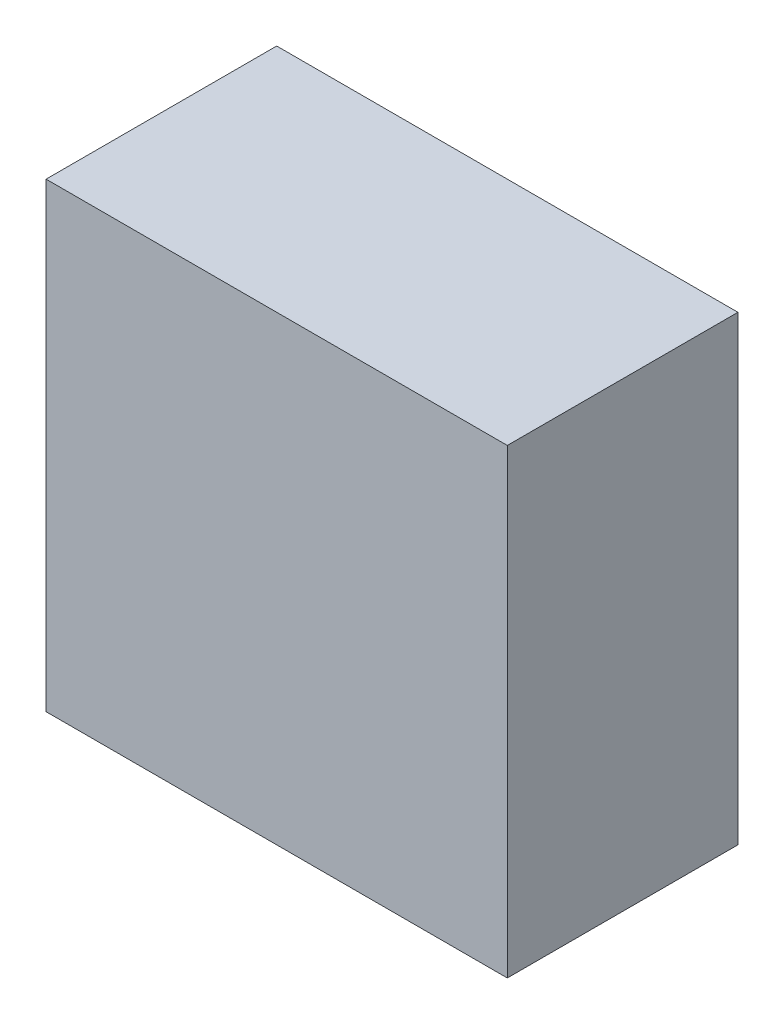
ISO-10303-21;
HEADER;
FILE_DESCRIPTION(('STEP AP214'),'2;1');
FILE_NAME('part.step','',(''),(''),'','','');
FILE_SCHEMA(('AUTOMOTIVE_DESIGN { 1 0 10303 214 1 1 1 1 }'));
ENDSEC;
DATA;
#1=APPLICATION_CONTEXT('core data for automotive mechanical design processes');
#2=APPLICATION_PROTOCOL_DEFINITION('international standard','automotive_design',2000,#1);
#3=PRODUCT_CONTEXT('',#1,'mechanical');
#4=PRODUCT('Part','Part','',(#3));
#5=PRODUCT_RELATED_PRODUCT_CATEGORY('part','',(#4));
#6=PRODUCT_DEFINITION_FORMATION('','',#4);
#7=PRODUCT_DEFINITION_CONTEXT('part definition',#1,'design');
#8=PRODUCT_DEFINITION('design','',#6,#7);
#9=PRODUCT_DEFINITION_SHAPE('','',#8);
#10=(LENGTH_UNIT() NAMED_UNIT(*) SI_UNIT(.MILLI.,.METRE.));
#11=(NAMED_UNIT(*) PLANE_ANGLE_UNIT() SI_UNIT($,.RADIAN.));
#12=(NAMED_UNIT(*) SI_UNIT($,.STERADIAN.) SOLID_ANGLE_UNIT());
#13=UNCERTAINTY_MEASURE_WITH_UNIT(LENGTH_MEASURE(1.E-05),#10,'distance_accuracy_value','');
#14=(GEOMETRIC_REPRESENTATION_CONTEXT(3) GLOBAL_UNCERTAINTY_ASSIGNED_CONTEXT((#13)) GLOBAL_UNIT_ASSIGNED_CONTEXT((#10,
#11,#12)) REPRESENTATION_CONTEXT('',''));
#15=CARTESIAN_POINT('',(0.,0.,0.));
#16=DIRECTION('',(0.,0.,1.));
#17=DIRECTION('',(1.,0.,0.));
#18=AXIS2_PLACEMENT_3D('',#15,#16,#17);
#19=CARTESIAN_POINT('',(0.,0.,2.75));
#20=DIRECTION('',(0.,0.,-1.));
#21=DIRECTION('',(-1.,0.,0.));
#22=AXIS2_PLACEMENT_3D('',#19,#20,#21);
#23=PLANE('',#22);
#24=DIRECTION('',(1.,0.,0.));
#25=VECTOR('',#24,1.);
#26=CARTESIAN_POINT('',(158.313158045853,52.9291158443043,2.75));
#27=LINE('',#26,#25);
#28=CARTESIAN_POINT('',(158.313158045853,52.9291158443043,2.75));
#29=VERTEX_POINT('',#28);
#30=CARTESIAN_POINT('',(154.313158045853,52.9291158443043,2.75));
#31=VERTEX_POINT('',#30);
#32=EDGE_CURVE('E80',#29,#31,#27,.F.);
#33=ORIENTED_EDGE('',*,*,#32,.T.);
#34=DIRECTION('',(0.,1.,0.));
#35=VECTOR('',#34,1.);
#36=CARTESIAN_POINT('',(154.313158045853,52.9291158443043,2.75));
#37=LINE('',#36,#35);
#38=CARTESIAN_POINT('',(154.313158045853,48.9291158443043,2.75));
#39=VERTEX_POINT('',#38);
#40=EDGE_CURVE('E55',#31,#39,#37,.F.);
#41=ORIENTED_EDGE('',*,*,#40,.T.);
#42=DIRECTION('',(1.,0.,0.));
#43=VECTOR('',#42,1.);
#44=CARTESIAN_POINT('',(158.313158045853,48.9291158443043,2.75));
#45=LINE('',#44,#43);
#46=CARTESIAN_POINT('',(158.313158045853,48.9291158443043,2.75));
#47=VERTEX_POINT('',#46);
#48=EDGE_CURVE('E57',#39,#47,#45,.T.);
#49=ORIENTED_EDGE('',*,*,#48,.T.);
#50=DIRECTION('',(0.,1.,0.));
#51=VECTOR('',#50,1.);
#52=CARTESIAN_POINT('',(158.313158045853,52.9291158443043,2.75));
#53=LINE('',#52,#51);
#54=EDGE_CURVE('E20',#47,#29,#53,.T.);
#55=ORIENTED_EDGE('',*,*,#54,.T.);
#56=EDGE_LOOP('',(#33,#41,#49,#55));
#57=FACE_BOUND('',#56,.T.);
#58=ADVANCED_FACE('F17',(#57),#23,.F.);
#59=CARTESIAN_POINT('',(158.313158045853,52.9291158443043,2.75));
#60=DIRECTION('',(-1.,0.,0.));
#61=DIRECTION('',(0.,0.,1.));
#62=AXIS2_PLACEMENT_3D('',#59,#60,#61);
#63=PLANE('',#62);
#64=DIRECTION('',(0.,0.,-1.));
#65=VECTOR('',#64,1.);
#66=CARTESIAN_POINT('',(158.313158045853,52.9291158443043,2.75));
#67=LINE('',#66,#65);
#68=CARTESIAN_POINT('',(158.313158045853,52.9291158443043,0.75));
#69=VERTEX_POINT('',#68);
#70=EDGE_CURVE('E68',#69,#29,#67,.F.);
#71=ORIENTED_EDGE('',*,*,#70,.T.);
#72=ORIENTED_EDGE('',*,*,#54,.F.);
#73=DIRECTION('',(0.,0.,1.));
#74=VECTOR('',#73,1.);
#75=CARTESIAN_POINT('',(158.313158045853,48.9291158443043,2.75));
#76=LINE('',#75,#74);
#77=CARTESIAN_POINT('',(158.313158045853,48.9291158443043,0.75));
#78=VERTEX_POINT('',#77);
#79=EDGE_CURVE('E63',#47,#78,#76,.F.);
#80=ORIENTED_EDGE('',*,*,#79,.T.);
#81=DIRECTION('',(0.,1.,0.));
#82=VECTOR('',#81,1.);
#83=CARTESIAN_POINT('',(158.313158045853,0.,0.75));
#84=LINE('',#83,#82);
#85=EDGE_CURVE('E83',#69,#78,#84,.F.);
#86=ORIENTED_EDGE('',*,*,#85,.F.);
#87=EDGE_LOOP('',(#71,#72,#80,#86));
#88=FACE_BOUND('',#87,.T.);
#89=ADVANCED_FACE('F65',(#88),#63,.F.);
#90=CARTESIAN_POINT('',(158.313158045853,48.9291158443043,2.75));
#91=DIRECTION('',(0.,1.,0.));
#92=DIRECTION('',(0.,0.,1.));
#93=AXIS2_PLACEMENT_3D('',#90,#91,#92);
#94=PLANE('',#93);
#95=ORIENTED_EDGE('',*,*,#79,.F.);
#96=ORIENTED_EDGE('',*,*,#48,.F.);
#97=DIRECTION('',(0.,0.,-1.));
#98=VECTOR('',#97,1.);
#99=CARTESIAN_POINT('',(154.313158045853,48.9291158443043,2.75));
#100=LINE('',#99,#98);
#101=CARTESIAN_POINT('',(154.313158045853,48.9291158443043,0.75));
#102=VERTEX_POINT('',#101);
#103=EDGE_CURVE('E75',#39,#102,#100,.T.);
#104=ORIENTED_EDGE('',*,*,#103,.T.);
#105=DIRECTION('',(-1.,0.,0.));
#106=VECTOR('',#105,1.);
#107=CARTESIAN_POINT('',(0.,48.9291158443043,0.75));
#108=LINE('',#107,#106);
#109=EDGE_CURVE('E72',#78,#102,#108,.T.);
#110=ORIENTED_EDGE('',*,*,#109,.F.);
#111=EDGE_LOOP('',(#95,#96,#104,#110));
#112=FACE_BOUND('',#111,.T.);
#113=ADVANCED_FACE('F70',(#112),#94,.F.);
#114=CARTESIAN_POINT('',(154.313158045853,52.9291158443043,2.75));
#115=DIRECTION('',(1.,0.,0.));
#116=DIRECTION('',(0.,0.,-1.));
#117=AXIS2_PLACEMENT_3D('',#114,#115,#116);
#118=PLANE('',#117);
#119=ORIENTED_EDGE('',*,*,#103,.F.);
#120=ORIENTED_EDGE('',*,*,#40,.F.);
#121=DIRECTION('',(0.,0.,-1.));
#122=VECTOR('',#121,1.);
#123=CARTESIAN_POINT('',(154.313158045853,52.9291158443043,2.75));
#124=LINE('',#123,#122);
#125=CARTESIAN_POINT('',(154.313158045853,52.9291158443043,0.75));
#126=VERTEX_POINT('',#125);
#127=EDGE_CURVE('E35',#31,#126,#124,.T.);
#128=ORIENTED_EDGE('',*,*,#127,.T.);
#129=DIRECTION('',(0.,1.,0.));
#130=VECTOR('',#129,1.);
#131=CARTESIAN_POINT('',(154.313158045853,0.,0.75));
#132=LINE('',#131,#130);
#133=EDGE_CURVE('E26',#102,#126,#132,.T.);
#134=ORIENTED_EDGE('',*,*,#133,.F.);
#135=EDGE_LOOP('',(#119,#120,#128,#134));
#136=FACE_BOUND('',#135,.T.);
#137=ADVANCED_FACE('F89',(#136),#118,.F.);
#138=CARTESIAN_POINT('',(158.313158045853,52.9291158443043,2.75));
#139=DIRECTION('',(0.,-1.,0.));
#140=DIRECTION('',(0.,0.,-1.));
#141=AXIS2_PLACEMENT_3D('',#138,#139,#140);
#142=PLANE('',#141);
#143=ORIENTED_EDGE('',*,*,#127,.F.);
#144=ORIENTED_EDGE('',*,*,#32,.F.);
#145=ORIENTED_EDGE('',*,*,#70,.F.);
#146=DIRECTION('',(-1.,0.,0.));
#147=VECTOR('',#146,1.);
#148=CARTESIAN_POINT('',(0.,52.9291158443043,0.75));
#149=LINE('',#148,#147);
#150=EDGE_CURVE('E11',#126,#69,#149,.F.);
#151=ORIENTED_EDGE('',*,*,#150,.F.);
#152=EDGE_LOOP('',(#143,#144,#145,#151));
#153=FACE_BOUND('',#152,.T.);
#154=ADVANCED_FACE('F91',(#153),#142,.F.);
#155=CARTESIAN_POINT('',(0.,0.,0.75));
#156=DIRECTION('',(0.,0.,-1.));
#157=DIRECTION('',(-1.,0.,0.));
#158=AXIS2_PLACEMENT_3D('',#155,#156,#157);
#159=PLANE('',#158);
#160=ORIENTED_EDGE('',*,*,#133,.T.);
#161=ORIENTED_EDGE('',*,*,#150,.T.);
#162=ORIENTED_EDGE('',*,*,#85,.T.);
#163=ORIENTED_EDGE('',*,*,#109,.T.);
#164=EDGE_LOOP('',(#160,#161,#162,#163));
#165=FACE_BOUND('',#164,.T.);
#166=ADVANCED_FACE('F88',(#165),#159,.T.);
#167=CLOSED_SHELL('',(#58,#89,#113,#137,#154,#166));
#168=MANIFOLD_SOLID_BREP('B1',#167);
#169=ADVANCED_BREP_SHAPE_REPRESENTATION('',(#18,#168),#14);
#170=SHAPE_DEFINITION_REPRESENTATION(#9,#169);
ENDSEC;
END-ISO-10303-21;
